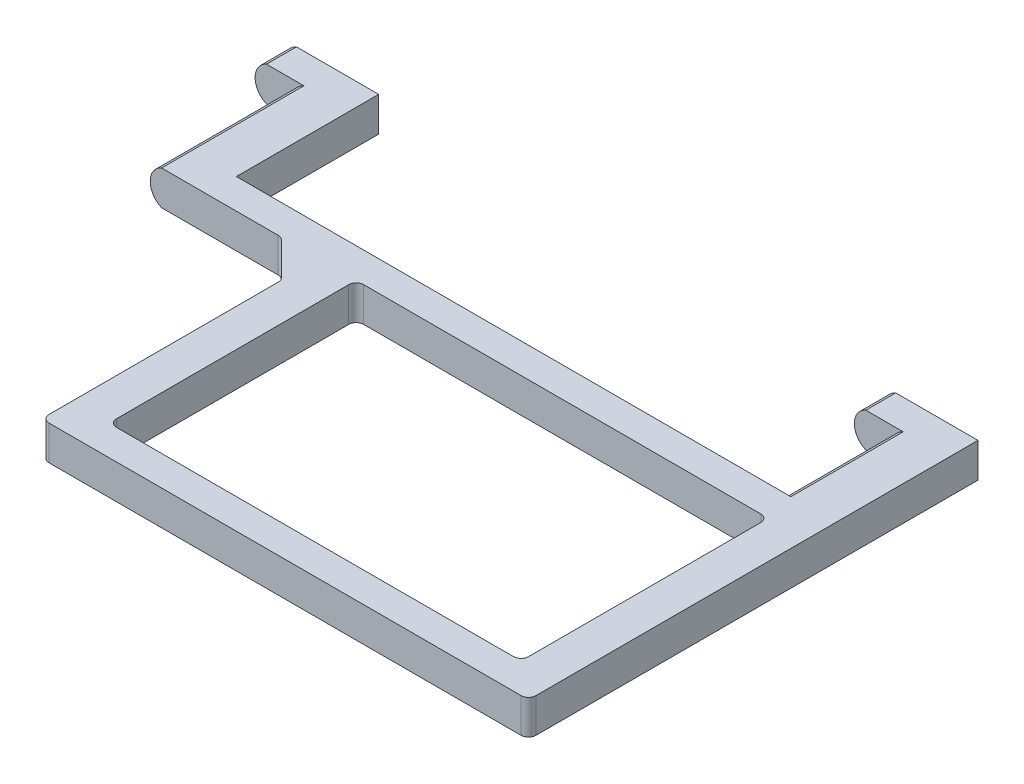
ISO-10303-21;
HEADER;
FILE_DESCRIPTION(('STEP AP214'),'2;1');
FILE_NAME('part.step','',(''),(''),'','','');
FILE_SCHEMA(('AUTOMOTIVE_DESIGN { 1 0 10303 214 1 1 1 1 }'));
ENDSEC;
DATA;
#1=APPLICATION_CONTEXT('core data for automotive mechanical design processes');
#2=APPLICATION_PROTOCOL_DEFINITION('international standard','automotive_design',2000,#1);
#3=PRODUCT_CONTEXT('',#1,'mechanical');
#4=PRODUCT('Part','Part','',(#3));
#5=PRODUCT_RELATED_PRODUCT_CATEGORY('part','',(#4));
#6=PRODUCT_DEFINITION_FORMATION('','',#4);
#7=PRODUCT_DEFINITION_CONTEXT('part definition',#1,'design');
#8=PRODUCT_DEFINITION('design','',#6,#7);
#9=PRODUCT_DEFINITION_SHAPE('','',#8);
#10=(LENGTH_UNIT() NAMED_UNIT(*) SI_UNIT(.MILLI.,.METRE.));
#11=(NAMED_UNIT(*) PLANE_ANGLE_UNIT() SI_UNIT($,.RADIAN.));
#12=(NAMED_UNIT(*) SI_UNIT($,.STERADIAN.) SOLID_ANGLE_UNIT());
#13=UNCERTAINTY_MEASURE_WITH_UNIT(LENGTH_MEASURE(1.E-05),#10,'distance_accuracy_value','');
#14=(GEOMETRIC_REPRESENTATION_CONTEXT(3) GLOBAL_UNCERTAINTY_ASSIGNED_CONTEXT((#13)) GLOBAL_UNIT_ASSIGNED_CONTEXT((#10,
#11,#12)) REPRESENTATION_CONTEXT('',''));
#15=CARTESIAN_POINT('',(0.,0.,0.));
#16=DIRECTION('',(0.,0.,1.));
#17=DIRECTION('',(1.,0.,0.));
#18=AXIS2_PLACEMENT_3D('',#15,#16,#17);
#19=CARTESIAN_POINT('',(449.301234579366,450.244075085687,-19.));
#20=DIRECTION('',(0.,0.,-1.));
#21=DIRECTION('',(-1.,0.,0.));
#22=AXIS2_PLACEMENT_3D('',#19,#20,#21);
#23=PLANE('',#22);
#24=DIRECTION('',(1.,0.,0.));
#25=VECTOR('',#24,1.);
#26=CARTESIAN_POINT('',(540.587671672653,452.544075085687,-19.));
#27=LINE('',#26,#25);
#28=CARTESIAN_POINT('',(448.321438682253,452.544075085687,-19.));
#29=VERTEX_POINT('',#28);
#30=CARTESIAN_POINT('',(459.301234579366,452.544075085687,-19.));
#31=VERTEX_POINT('',#30);
#32=EDGE_CURVE('E262',#29,#31,#27,.T.);
#33=ORIENTED_EDGE('',*,*,#32,.T.);
#34=DIRECTION('',(0.,-1.,0.));
#35=VECTOR('',#34,1.);
#36=CARTESIAN_POINT('',(459.301234579366,452.744075085687,-19.));
#37=LINE('',#36,#35);
#38=CARTESIAN_POINT('',(459.301234579366,447.944075085687,-19.));
#39=VERTEX_POINT('',#38);
#40=EDGE_CURVE('E328',#31,#39,#37,.T.);
#41=ORIENTED_EDGE('',*,*,#40,.T.);
#42=DIRECTION('',(-1.,0.,0.));
#43=VECTOR('',#42,1.);
#44=CARTESIAN_POINT('',(540.587671672653,447.944075085687,-19.));
#45=LINE('',#44,#43);
#46=CARTESIAN_POINT('',(448.321438682253,447.944075085687,-19.));
#47=VERTEX_POINT('',#46);
#48=EDGE_CURVE('E441',#39,#47,#45,.T.);
#49=ORIENTED_EDGE('',*,*,#48,.T.);
#50=CARTESIAN_POINT('',(449.301234579366,450.244075085687,-19.));
#51=DIRECTION('',(0.,0.,-1.));
#52=DIRECTION('',(-1.,0.,0.));
#53=AXIS2_PLACEMENT_3D('',#50,#51,#52);
#54=CIRCLE('',#53,2.5);
#55=EDGE_CURVE('E325',#47,#29,#54,.T.);
#56=ORIENTED_EDGE('',*,*,#55,.T.);
#57=EDGE_LOOP('',(#33,#41,#49,#56));
#58=FACE_BOUND('',#57,.T.);
#59=ADVANCED_FACE('F39',(#58),#23,.T.);
#60=CARTESIAN_POINT('',(449.301234579366,450.244075085687,-15.));
#61=DIRECTION('',(0.,0.,-1.));
#62=DIRECTION('',(-1.,0.,0.));
#63=AXIS2_PLACEMENT_3D('',#60,#61,#62);
#64=PLANE('',#63);
#65=CARTESIAN_POINT('',(454.301234579366,450.244075085687,-15.));
#66=DIRECTION('',(0.,0.,1.));
#67=DIRECTION('',(1.,0.,0.));
#68=AXIS2_PLACEMENT_3D('',#65,#66,#67);
#69=CIRCLE('',#68,2.5);
#70=CARTESIAN_POINT('',(453.321438682253,447.944075085687,-15.));
#71=VERTEX_POINT('',#70);
#72=CARTESIAN_POINT('',(453.321438682253,452.544075085687,-15.));
#73=VERTEX_POINT('',#72);
#74=EDGE_CURVE('E318',#71,#73,#69,.F.);
#75=ORIENTED_EDGE('',*,*,#74,.T.);
#76=DIRECTION('',(-1.,0.,0.));
#77=VECTOR('',#76,1.);
#78=CARTESIAN_POINT('',(449.301234579366,452.544075085687,-15.));
#79=LINE('',#78,#77);
#80=CARTESIAN_POINT('',(448.321438682253,452.544075085687,-15.));
#81=VERTEX_POINT('',#80);
#82=EDGE_CURVE('E372',#73,#81,#79,.T.);
#83=ORIENTED_EDGE('',*,*,#82,.T.);
#84=CARTESIAN_POINT('',(449.301234579366,450.244075085687,-15.));
#85=DIRECTION('',(0.,0.,-1.));
#86=DIRECTION('',(-1.,0.,0.));
#87=AXIS2_PLACEMENT_3D('',#84,#85,#86);
#88=CIRCLE('',#87,2.5);
#89=CARTESIAN_POINT('',(448.321438682253,447.944075085687,-15.));
#90=VERTEX_POINT('',#89);
#91=EDGE_CURVE('E322',#90,#81,#88,.T.);
#92=ORIENTED_EDGE('',*,*,#91,.F.);
#93=DIRECTION('',(1.,0.,0.));
#94=VECTOR('',#93,1.);
#95=CARTESIAN_POINT('',(449.301234579366,447.944075085687,-15.));
#96=LINE('',#95,#94);
#97=EDGE_CURVE('E427',#90,#71,#96,.T.);
#98=ORIENTED_EDGE('',*,*,#97,.T.);
#99=EDGE_LOOP('',(#75,#83,#92,#98));
#100=FACE_BOUND('',#99,.T.);
#101=ADVANCED_FACE('F500',(#100),#64,.F.);
#102=CARTESIAN_POINT('',(449.301234579366,450.244075085687,-19.));
#103=DIRECTION('',(0.,0.,1.));
#104=DIRECTION('',(1.,0.,0.));
#105=AXIS2_PLACEMENT_3D('',#102,#103,#104);
#106=CYLINDRICAL_SURFACE('',#105,2.5);
#107=ORIENTED_EDGE('',*,*,#91,.T.);
#108=DIRECTION('',(0.,0.,1.));
#109=VECTOR('',#108,1.);
#110=CARTESIAN_POINT('',(448.321438682253,452.544075085687,-19.));
#111=LINE('',#110,#109);
#112=EDGE_CURVE('E369',#81,#29,#111,.F.);
#113=ORIENTED_EDGE('',*,*,#112,.T.);
#114=ORIENTED_EDGE('',*,*,#55,.F.);
#115=DIRECTION('',(0.,0.,1.));
#116=VECTOR('',#115,1.);
#117=CARTESIAN_POINT('',(448.321438682253,447.944075085687,-19.));
#118=LINE('',#117,#116);
#119=EDGE_CURVE('E227',#47,#90,#118,.T.);
#120=ORIENTED_EDGE('',*,*,#119,.T.);
#121=EDGE_LOOP('',(#107,#113,#114,#120));
#122=FACE_BOUND('',#121,.T.);
#123=ADVANCED_FACE('F502',(#122),#106,.T.);
#124=CARTESIAN_POINT('',(459.301234579366,452.744075085687,-24.01387818866));
#125=DIRECTION('',(1.,0.,0.));
#126=DIRECTION('',(0.,0.,-1.));
#127=AXIS2_PLACEMENT_3D('',#124,#125,#126);
#128=PLANE('',#127);
#129=DIRECTION('',(0.,0.,-1.));
#130=VECTOR('',#129,1.);
#131=CARTESIAN_POINT('',(459.301234579366,452.544075085687,-24.01387818866));
#132=LINE('',#131,#130);
#133=CARTESIAN_POINT('',(459.301234579366,452.544075085687,0.));
#134=VERTEX_POINT('',#133);
#135=EDGE_CURVE('E344',#134,#31,#132,.T.);
#136=ORIENTED_EDGE('',*,*,#135,.F.);
#137=DIRECTION('',(0.,1.,0.));
#138=VECTOR('',#137,1.);
#139=CARTESIAN_POINT('',(459.301234579366,452.744075085687,0.));
#140=LINE('',#139,#138);
#141=CARTESIAN_POINT('',(459.301234579366,447.944075085687,0.));
#142=VERTEX_POINT('',#141);
#143=EDGE_CURVE('E319',#142,#134,#140,.T.);
#144=ORIENTED_EDGE('',*,*,#143,.F.);
#145=DIRECTION('',(0.,0.,1.));
#146=VECTOR('',#145,1.);
#147=CARTESIAN_POINT('',(459.301234579366,447.944075085687,-24.01387818866));
#148=LINE('',#147,#146);
#149=EDGE_CURVE('E401',#39,#142,#148,.T.);
#150=ORIENTED_EDGE('',*,*,#149,.F.);
#151=ORIENTED_EDGE('',*,*,#40,.F.);
#152=EDGE_LOOP('',(#136,#144,#150,#151));
#153=FACE_BOUND('',#152,.T.);
#154=ADVANCED_FACE('F457',(#153),#128,.T.);
#155=CARTESIAN_POINT('',(454.301234579366,450.244075085687,0.));
#156=DIRECTION('',(0.,0.,1.));
#157=DIRECTION('',(1.,0.,0.));
#158=AXIS2_PLACEMENT_3D('',#155,#156,#157);
#159=PLANE('',#158);
#160=ORIENTED_EDGE('',*,*,#143,.T.);
#161=DIRECTION('',(1.,0.,0.));
#162=VECTOR('',#161,1.);
#163=CARTESIAN_POINT('',(454.301234579366,452.544075085687,0.));
#164=LINE('',#163,#162);
#165=CARTESIAN_POINT('',(533.321438682253,452.544075085687,0.));
#166=VERTEX_POINT('',#165);
#167=EDGE_CURVE('E341',#134,#166,#164,.T.);
#168=ORIENTED_EDGE('',*,*,#167,.T.);
#169=CARTESIAN_POINT('',(534.301234579366,450.244075085687,0.));
#170=DIRECTION('',(0.,0.,1.));
#171=DIRECTION('',(1.,0.,0.));
#172=AXIS2_PLACEMENT_3D('',#169,#170,#171);
#173=CIRCLE('',#172,2.5);
#174=CARTESIAN_POINT('',(533.321438682253,447.944075085687,0.));
#175=VERTEX_POINT('',#174);
#176=EDGE_CURVE('E300',#166,#175,#173,.T.);
#177=ORIENTED_EDGE('',*,*,#176,.T.);
#178=DIRECTION('',(-1.,0.,0.));
#179=VECTOR('',#178,1.);
#180=CARTESIAN_POINT('',(454.301234579366,447.944075085687,0.));
#181=LINE('',#180,#179);
#182=EDGE_CURVE('E398',#175,#142,#181,.T.);
#183=ORIENTED_EDGE('',*,*,#182,.T.);
#184=EDGE_LOOP('',(#160,#168,#177,#183));
#185=FACE_BOUND('',#184,.T.);
#186=ADVANCED_FACE('F461',(#185),#159,.F.);
#187=CARTESIAN_POINT('',(454.301234579366,450.244075085687,4.));
#188=DIRECTION('',(0.,0.,-1.));
#189=DIRECTION('',(-1.,0.,0.));
#190=AXIS2_PLACEMENT_3D('',#187,#188,#189);
#191=CYLINDRICAL_SURFACE('',#190,2.5);
#192=CARTESIAN_POINT('',(454.301234579366,450.244075085687,4.));
#193=DIRECTION('',(0.,0.,1.));
#194=DIRECTION('',(1.,0.,0.));
#195=AXIS2_PLACEMENT_3D('',#192,#193,#194);
#196=CIRCLE('',#195,2.5);
#197=CARTESIAN_POINT('',(453.321438682253,452.544075085687,4.));
#198=VERTEX_POINT('',#197);
#199=CARTESIAN_POINT('',(453.321438682253,447.944075085687,4.));
#200=VERTEX_POINT('',#199);
#201=EDGE_CURVE('E311',#198,#200,#196,.T.);
#202=ORIENTED_EDGE('',*,*,#201,.F.);
#203=DIRECTION('',(0.,0.,-1.));
#204=VECTOR('',#203,1.);
#205=CARTESIAN_POINT('',(453.321438682253,452.544075085687,4.));
#206=LINE('',#205,#204);
#207=EDGE_CURVE('E375',#198,#73,#206,.T.);
#208=ORIENTED_EDGE('',*,*,#207,.T.);
#209=ORIENTED_EDGE('',*,*,#74,.F.);
#210=DIRECTION('',(0.,0.,-1.));
#211=VECTOR('',#210,1.);
#212=CARTESIAN_POINT('',(453.321438682253,447.944075085687,4.));
#213=LINE('',#212,#211);
#214=EDGE_CURVE('E430',#71,#200,#213,.F.);
#215=ORIENTED_EDGE('',*,*,#214,.T.);
#216=EDGE_LOOP('',(#202,#208,#209,#215));
#217=FACE_BOUND('',#216,.T.);
#218=ADVANCED_FACE('F496',(#217),#191,.T.);
#219=CARTESIAN_POINT('',(529.301234579366,450.244075085687,-19.));
#220=DIRECTION('',(0.,0.,-1.));
#221=DIRECTION('',(-1.,0.,0.));
#222=AXIS2_PLACEMENT_3D('',#219,#220,#221);
#223=PLANE('',#222);
#224=CARTESIAN_POINT('',(528.321438682253,452.544075085687,-19.));
#225=VERTEX_POINT('',#224);
#226=CARTESIAN_POINT('',(539.301234579366,452.544075085687,-19.));
#227=VERTEX_POINT('',#226);
#228=EDGE_CURVE('E445',#225,#227,#27,.T.);
#229=ORIENTED_EDGE('',*,*,#228,.T.);
#230=DIRECTION('',(0.,-1.,0.));
#231=VECTOR('',#230,1.);
#232=CARTESIAN_POINT('',(539.301234579366,452.744075085687,-19.));
#233=LINE('',#232,#231);
#234=CARTESIAN_POINT('',(539.301234579366,447.944075085687,-19.));
#235=VERTEX_POINT('',#234);
#236=EDGE_CURVE('E304',#227,#235,#233,.T.);
#237=ORIENTED_EDGE('',*,*,#236,.T.);
#238=CARTESIAN_POINT('',(528.321438682253,447.944075085687,-19.));
#239=VERTEX_POINT('',#238);
#240=EDGE_CURVE('E238',#235,#239,#45,.T.);
#241=ORIENTED_EDGE('',*,*,#240,.T.);
#242=CARTESIAN_POINT('',(529.301234579366,450.244075085687,-19.));
#243=DIRECTION('',(0.,0.,-1.));
#244=DIRECTION('',(-1.,0.,0.));
#245=AXIS2_PLACEMENT_3D('',#242,#243,#244);
#246=CIRCLE('',#245,2.5);
#247=EDGE_CURVE('E310',#239,#225,#246,.T.);
#248=ORIENTED_EDGE('',*,*,#247,.T.);
#249=EDGE_LOOP('',(#229,#237,#241,#248));
#250=FACE_BOUND('',#249,.T.);
#251=ADVANCED_FACE('F474',(#250),#223,.T.);
#252=CARTESIAN_POINT('',(529.301234579366,450.244075085687,-15.));
#253=DIRECTION('',(0.,0.,-1.));
#254=DIRECTION('',(-1.,0.,0.));
#255=AXIS2_PLACEMENT_3D('',#252,#253,#254);
#256=PLANE('',#255);
#257=CARTESIAN_POINT('',(534.301234579366,450.244075085687,-15.));
#258=DIRECTION('',(0.,0.,1.));
#259=DIRECTION('',(1.,0.,0.));
#260=AXIS2_PLACEMENT_3D('',#257,#258,#259);
#261=CIRCLE('',#260,2.5);
#262=CARTESIAN_POINT('',(533.321438682253,447.944075085687,-15.));
#263=VERTEX_POINT('',#262);
#264=CARTESIAN_POINT('',(533.321438682253,452.544075085687,-15.));
#265=VERTEX_POINT('',#264);
#266=EDGE_CURVE('E301',#263,#265,#261,.F.);
#267=ORIENTED_EDGE('',*,*,#266,.T.);
#268=DIRECTION('',(-1.,0.,0.));
#269=VECTOR('',#268,1.);
#270=CARTESIAN_POINT('',(529.301234579366,452.544075085687,-15.));
#271=LINE('',#270,#269);
#272=CARTESIAN_POINT('',(528.321438682253,452.544075085687,-15.));
#273=VERTEX_POINT('',#272);
#274=EDGE_CURVE('E336',#265,#273,#271,.T.);
#275=ORIENTED_EDGE('',*,*,#274,.T.);
#276=CARTESIAN_POINT('',(529.301234579366,450.244075085687,-15.));
#277=DIRECTION('',(0.,0.,-1.));
#278=DIRECTION('',(-1.,0.,0.));
#279=AXIS2_PLACEMENT_3D('',#276,#277,#278);
#280=CIRCLE('',#279,2.5);
#281=CARTESIAN_POINT('',(528.321438682253,447.944075085687,-15.));
#282=VERTEX_POINT('',#281);
#283=EDGE_CURVE('E307',#282,#273,#280,.T.);
#284=ORIENTED_EDGE('',*,*,#283,.F.);
#285=DIRECTION('',(1.,0.,0.));
#286=VECTOR('',#285,1.);
#287=CARTESIAN_POINT('',(529.301234579366,447.944075085687,-15.));
#288=LINE('',#287,#286);
#289=EDGE_CURVE('E393',#282,#263,#288,.T.);
#290=ORIENTED_EDGE('',*,*,#289,.T.);
#291=EDGE_LOOP('',(#267,#275,#284,#290));
#292=FACE_BOUND('',#291,.T.);
#293=ADVANCED_FACE('F469',(#292),#256,.F.);
#294=CARTESIAN_POINT('',(529.301234579366,450.244075085687,-19.));
#295=DIRECTION('',(0.,0.,1.));
#296=DIRECTION('',(1.,0.,0.));
#297=AXIS2_PLACEMENT_3D('',#294,#295,#296);
#298=CYLINDRICAL_SURFACE('',#297,2.5);
#299=ORIENTED_EDGE('',*,*,#283,.T.);
#300=DIRECTION('',(0.,0.,1.));
#301=VECTOR('',#300,1.);
#302=CARTESIAN_POINT('',(528.321438682253,452.544075085687,-19.));
#303=LINE('',#302,#301);
#304=EDGE_CURVE('E331',#273,#225,#303,.F.);
#305=ORIENTED_EDGE('',*,*,#304,.T.);
#306=ORIENTED_EDGE('',*,*,#247,.F.);
#307=DIRECTION('',(0.,0.,1.));
#308=VECTOR('',#307,1.);
#309=CARTESIAN_POINT('',(528.321438682253,447.944075085687,-19.));
#310=LINE('',#309,#308);
#311=EDGE_CURVE('E390',#239,#282,#310,.T.);
#312=ORIENTED_EDGE('',*,*,#311,.T.);
#313=EDGE_LOOP('',(#299,#305,#306,#312));
#314=FACE_BOUND('',#313,.T.);
#315=ADVANCED_FACE('F471',(#314),#298,.T.);
#316=CARTESIAN_POINT('',(473.301234579366,447.744075085687,9.41421356237312));
#317=DIRECTION('',(0.,-1.,0.));
#318=DIRECTION('',(0.,0.,-1.));
#319=AXIS2_PLACEMENT_3D('',#316,#317,#318);
#320=CYLINDRICAL_SURFACE('',#319,1.);
#321=DIRECTION('',(0.,-1.,0.));
#322=VECTOR('',#321,1.);
#323=CARTESIAN_POINT('',(474.301234579366,447.744075085687,9.41421356237312));
#324=LINE('',#323,#322);
#325=CARTESIAN_POINT('',(474.301234579366,452.544075085687,9.41421356237312));
#326=VERTEX_POINT('',#325);
#327=CARTESIAN_POINT('',(474.301234579366,447.944075085687,9.41421356237312));
#328=VERTEX_POINT('',#327);
#329=EDGE_CURVE('E246',#326,#328,#324,.T.);
#330=ORIENTED_EDGE('',*,*,#329,.F.);
#331=CARTESIAN_POINT('',(473.301234579366,452.544075085687,9.41421356237312));
#332=DIRECTION('',(0.,-1.,0.));
#333=DIRECTION('',(0.,0.,-1.));
#334=AXIS2_PLACEMENT_3D('',#331,#332,#333);
#335=CIRCLE('',#334,1.);
#336=CARTESIAN_POINT('',(474.008341360553,452.544075085687,8.70710678118659));
#337=VERTEX_POINT('',#336);
#338=EDGE_CURVE('E385',#326,#337,#335,.F.);
#339=ORIENTED_EDGE('',*,*,#338,.T.);
#340=DIRECTION('',(0.,-1.,0.));
#341=VECTOR('',#340,1.);
#342=CARTESIAN_POINT('',(474.008341360553,459.815142897552,8.70710678118657));
#343=LINE('',#342,#341);
#344=CARTESIAN_POINT('',(474.008341360553,447.944075085687,8.70710678118659));
#345=VERTEX_POINT('',#344);
#346=EDGE_CURVE('E273',#345,#337,#343,.F.);
#347=ORIENTED_EDGE('',*,*,#346,.F.);
#348=CARTESIAN_POINT('',(473.301234579366,447.944075085687,9.41421356237312));
#349=DIRECTION('',(0.,1.,0.));
#350=DIRECTION('',(0.,0.,1.));
#351=AXIS2_PLACEMENT_3D('',#348,#349,#350);
#352=CIRCLE('',#351,1.);
#353=EDGE_CURVE('E261',#345,#328,#352,.F.);
#354=ORIENTED_EDGE('',*,*,#353,.T.);
#355=EDGE_LOOP('',(#330,#339,#347,#354));
#356=FACE_BOUND('',#355,.T.);
#357=ADVANCED_FACE('F480',(#356),#320,.F.);
#358=CARTESIAN_POINT('',(468.887021016993,459.815142897552,5.));
#359=DIRECTION('',(0.,1.,0.));
#360=DIRECTION('',(0.,0.,1.));
#361=AXIS2_PLACEMENT_3D('',#358,#359,#360);
#362=CYLINDRICAL_SURFACE('',#361,1.);
#363=DIRECTION('',(0.,-1.,0.));
#364=VECTOR('',#363,1.);
#365=CARTESIAN_POINT('',(469.59412779818,447.744075085687,4.29289321881343));
#366=LINE('',#365,#364);
#367=CARTESIAN_POINT('',(469.59412779818,452.544075085687,4.29289321881345));
#368=VERTEX_POINT('',#367);
#369=CARTESIAN_POINT('',(469.59412779818,447.944075085687,4.29289321881345));
#370=VERTEX_POINT('',#369);
#371=EDGE_CURVE('E268',#368,#370,#366,.T.);
#372=ORIENTED_EDGE('',*,*,#371,.F.);
#373=CARTESIAN_POINT('',(468.887021016993,452.544075085687,5.));
#374=DIRECTION('',(0.,-1.,0.));
#375=DIRECTION('',(0.,0.,-1.));
#376=AXIS2_PLACEMENT_3D('',#373,#374,#375);
#377=CIRCLE('',#376,1.);
#378=CARTESIAN_POINT('',(468.887021016993,452.544075085687,4.));
#379=VERTEX_POINT('',#378);
#380=EDGE_CURVE('E380',#368,#379,#377,.F.);
#381=ORIENTED_EDGE('',*,*,#380,.T.);
#382=DIRECTION('',(0.,-1.,0.));
#383=VECTOR('',#382,1.);
#384=CARTESIAN_POINT('',(468.887021016993,452.744075085687,4.));
#385=LINE('',#384,#383);
#386=CARTESIAN_POINT('',(468.887021016993,447.944075085687,4.));
#387=VERTEX_POINT('',#386);
#388=EDGE_CURVE('E265',#387,#379,#385,.F.);
#389=ORIENTED_EDGE('',*,*,#388,.F.);
#390=CARTESIAN_POINT('',(468.887021016993,447.944075085687,5.));
#391=DIRECTION('',(0.,1.,0.));
#392=DIRECTION('',(0.,0.,1.));
#393=AXIS2_PLACEMENT_3D('',#390,#391,#392);
#394=CIRCLE('',#393,1.);
#395=EDGE_CURVE('E435',#387,#370,#394,.F.);
#396=ORIENTED_EDGE('',*,*,#395,.T.);
#397=EDGE_LOOP('',(#372,#381,#389,#396));
#398=FACE_BOUND('',#397,.T.);
#399=ADVANCED_FACE('F488',(#398),#362,.F.);
#400=CARTESIAN_POINT('',(469.301234579366,459.815142897552,4.));
#401=DIRECTION('',(-0.707106781186547,0.,0.707106781186547));
#402=DIRECTION('',(0.707106781186548,0.,0.707106781186547));
#403=AXIS2_PLACEMENT_3D('',#400,#401,#402);
#404=PLANE('',#403);
#405=DIRECTION('',(0.707106781186548,0.,0.707106781186547));
#406=VECTOR('',#405,1.);
#407=CARTESIAN_POINT('',(469.301234579366,452.544075085687,4.));
#408=LINE('',#407,#406);
#409=EDGE_CURVE('E383',#368,#337,#408,.T.);
#410=ORIENTED_EDGE('',*,*,#409,.F.);
#411=ORIENTED_EDGE('',*,*,#371,.T.);
#412=DIRECTION('',(-0.707106781186548,0.,-0.707106781186547));
#413=VECTOR('',#412,1.);
#414=CARTESIAN_POINT('',(469.301234579366,447.944075085687,4.));
#415=LINE('',#414,#413);
#416=EDGE_CURVE('E438',#345,#370,#415,.T.);
#417=ORIENTED_EDGE('',*,*,#416,.F.);
#418=ORIENTED_EDGE('',*,*,#346,.T.);
#419=EDGE_LOOP('',(#410,#411,#417,#418));
#420=FACE_BOUND('',#419,.T.);
#421=ADVANCED_FACE('F485',(#420),#404,.T.);
#422=CARTESIAN_POINT('',(475.301234579366,0.,40.));
#423=DIRECTION('',(0.,-1.,0.));
#424=DIRECTION('',(0.,0.,-1.));
#425=AXIS2_PLACEMENT_3D('',#422,#423,#424);
#426=CYLINDRICAL_SURFACE('',#425,1.);
#427=CARTESIAN_POINT('',(475.301234579366,452.544075085687,40.));
#428=DIRECTION('',(0.,-1.,0.));
#429=DIRECTION('',(0.,0.,-1.));
#430=AXIS2_PLACEMENT_3D('',#427,#428,#429);
#431=CIRCLE('',#430,1.);
#432=CARTESIAN_POINT('',(474.301234579366,452.544075085687,40.));
#433=VERTEX_POINT('',#432);
#434=CARTESIAN_POINT('',(475.301234579366,452.544075085687,41.));
#435=VERTEX_POINT('',#434);
#436=EDGE_CURVE('E11',#433,#435,#431,.F.);
#437=ORIENTED_EDGE('',*,*,#436,.F.);
#438=DIRECTION('',(0.,-1.,0.));
#439=VECTOR('',#438,1.);
#440=CARTESIAN_POINT('',(474.301234579366,447.744075085687,40.));
#441=LINE('',#440,#439);
#442=CARTESIAN_POINT('',(474.301234579366,447.944075085687,40.));
#443=VERTEX_POINT('',#442);
#444=EDGE_CURVE('E259',#443,#433,#441,.F.);
#445=ORIENTED_EDGE('',*,*,#444,.F.);
#446=CARTESIAN_POINT('',(475.301234579366,447.944075085687,40.));
#447=DIRECTION('',(0.,1.,0.));
#448=DIRECTION('',(0.,0.,1.));
#449=AXIS2_PLACEMENT_3D('',#446,#447,#448);
#450=CIRCLE('',#449,1.);
#451=CARTESIAN_POINT('',(475.301234579366,447.944075085687,41.));
#452=VERTEX_POINT('',#451);
#453=EDGE_CURVE('E47',#452,#443,#450,.F.);
#454=ORIENTED_EDGE('',*,*,#453,.F.);
#455=DIRECTION('',(0.,-1.,0.));
#456=VECTOR('',#455,1.);
#457=CARTESIAN_POINT('',(475.301234579366,0.,41.));
#458=LINE('',#457,#456);
#459=EDGE_CURVE('E236',#435,#452,#458,.T.);
#460=ORIENTED_EDGE('',*,*,#459,.F.);
#461=EDGE_LOOP('',(#437,#445,#454,#460));
#462=FACE_BOUND('',#461,.T.);
#463=ADVANCED_FACE('F41',(#462),#426,.T.);
#464=CARTESIAN_POINT('',(474.301234579366,447.744075085687,41.));
#465=DIRECTION('',(1.,0.,0.));
#466=DIRECTION('',(0.,0.,-1.));
#467=AXIS2_PLACEMENT_3D('',#464,#465,#466);
#468=PLANE('',#467);
#469=ORIENTED_EDGE('',*,*,#444,.T.);
#470=DIRECTION('',(0.,0.,-1.));
#471=VECTOR('',#470,1.);
#472=CARTESIAN_POINT('',(474.301234579366,452.544075085687,41.));
#473=LINE('',#472,#471);
#474=EDGE_CURVE('E388',#433,#326,#473,.T.);
#475=ORIENTED_EDGE('',*,*,#474,.T.);
#476=ORIENTED_EDGE('',*,*,#329,.T.);
#477=DIRECTION('',(0.,0.,1.));
#478=VECTOR('',#477,1.);
#479=CARTESIAN_POINT('',(474.301234579366,447.944075085687,41.));
#480=LINE('',#479,#478);
#481=EDGE_CURVE('E250',#328,#443,#480,.T.);
#482=ORIENTED_EDGE('',*,*,#481,.T.);
#483=EDGE_LOOP('',(#469,#475,#476,#482));
#484=FACE_BOUND('',#483,.T.);
#485=ADVANCED_FACE('F257',(#484),#468,.F.);
#486=CARTESIAN_POINT('',(538.301234579366,0.,40.));
#487=DIRECTION('',(0.,-1.,0.));
#488=DIRECTION('',(0.,0.,-1.));
#489=AXIS2_PLACEMENT_3D('',#486,#487,#488);
#490=CYLINDRICAL_SURFACE('',#489,1.);
#491=CARTESIAN_POINT('',(538.301234579366,452.544075085687,40.));
#492=DIRECTION('',(0.,-1.,0.));
#493=DIRECTION('',(0.,0.,-1.));
#494=AXIS2_PLACEMENT_3D('',#491,#492,#493);
#495=CIRCLE('',#494,1.);
#496=CARTESIAN_POINT('',(538.301234579366,452.544075085687,41.));
#497=VERTEX_POINT('',#496);
#498=CARTESIAN_POINT('',(539.301234579366,452.544075085687,40.));
#499=VERTEX_POINT('',#498);
#500=EDGE_CURVE('E242',#497,#499,#495,.F.);
#501=ORIENTED_EDGE('',*,*,#500,.F.);
#502=DIRECTION('',(0.,1.,0.));
#503=VECTOR('',#502,1.);
#504=CARTESIAN_POINT('',(538.301234579366,452.744075085687,41.));
#505=LINE('',#504,#503);
#506=CARTESIAN_POINT('',(538.301234579366,447.944075085687,41.));
#507=VERTEX_POINT('',#506);
#508=EDGE_CURVE('E234',#507,#497,#505,.T.);
#509=ORIENTED_EDGE('',*,*,#508,.F.);
#510=CARTESIAN_POINT('',(538.301234579366,447.944075085687,40.));
#511=DIRECTION('',(0.,1.,0.));
#512=DIRECTION('',(0.,0.,1.));
#513=AXIS2_PLACEMENT_3D('',#510,#511,#512);
#514=CIRCLE('',#513,1.);
#515=CARTESIAN_POINT('',(539.301234579366,447.944075085687,40.));
#516=VERTEX_POINT('',#515);
#517=EDGE_CURVE('E216',#516,#507,#514,.F.);
#518=ORIENTED_EDGE('',*,*,#517,.F.);
#519=DIRECTION('',(0.,1.,0.));
#520=VECTOR('',#519,1.);
#521=CARTESIAN_POINT('',(539.301234579366,447.744075085687,40.));
#522=LINE('',#521,#520);
#523=EDGE_CURVE('E243',#499,#516,#522,.F.);
#524=ORIENTED_EDGE('',*,*,#523,.F.);
#525=EDGE_LOOP('',(#501,#509,#518,#524));
#526=FACE_BOUND('',#525,.T.);
#527=ADVANCED_FACE('F241',(#526),#490,.T.);
#528=CARTESIAN_POINT('',(0.,0.,41.));
#529=DIRECTION('',(0.,0.,-1.));
#530=DIRECTION('',(-1.,0.,0.));
#531=AXIS2_PLACEMENT_3D('',#528,#529,#530);
#532=PLANE('',#531);
#533=ORIENTED_EDGE('',*,*,#508,.T.);
#534=DIRECTION('',(1.,0.,0.));
#535=VECTOR('',#534,1.);
#536=CARTESIAN_POINT('',(540.587671672653,452.544075085687,41.));
#537=LINE('',#536,#535);
#538=EDGE_CURVE('E237',#435,#497,#537,.T.);
#539=ORIENTED_EDGE('',*,*,#538,.F.);
#540=ORIENTED_EDGE('',*,*,#459,.T.);
#541=DIRECTION('',(-1.,0.,0.));
#542=VECTOR('',#541,1.);
#543=CARTESIAN_POINT('',(540.587671672653,447.944075085687,41.));
#544=LINE('',#543,#542);
#545=EDGE_CURVE('E219',#507,#452,#544,.T.);
#546=ORIENTED_EDGE('',*,*,#545,.F.);
#547=EDGE_LOOP('',(#533,#539,#540,#546));
#548=FACE_BOUND('',#547,.T.);
#549=ADVANCED_FACE('F232',(#548),#532,.F.);
#550=CARTESIAN_POINT('',(539.301234579366,452.744075085687,-24.01387818866));
#551=DIRECTION('',(1.,0.,0.));
#552=DIRECTION('',(0.,0.,-1.));
#553=AXIS2_PLACEMENT_3D('',#550,#551,#552);
#554=PLANE('',#553);
#555=DIRECTION('',(0.,0.,-1.));
#556=VECTOR('',#555,1.);
#557=CARTESIAN_POINT('',(539.301234579366,452.544075085687,-24.01387818866));
#558=LINE('',#557,#556);
#559=EDGE_CURVE('E366',#499,#227,#558,.T.);
#560=ORIENTED_EDGE('',*,*,#559,.F.);
#561=ORIENTED_EDGE('',*,*,#523,.T.);
#562=DIRECTION('',(0.,0.,1.));
#563=VECTOR('',#562,1.);
#564=CARTESIAN_POINT('',(539.301234579366,447.944075085687,-24.01387818866));
#565=LINE('',#564,#563);
#566=EDGE_CURVE('E222',#235,#516,#565,.T.);
#567=ORIENTED_EDGE('',*,*,#566,.F.);
#568=ORIENTED_EDGE('',*,*,#236,.F.);
#569=EDGE_LOOP('',(#560,#561,#567,#568));
#570=FACE_BOUND('',#569,.T.);
#571=ADVANCED_FACE('F477',(#570),#554,.T.);
#572=CARTESIAN_POINT('',(534.301234579366,450.244075085687,-24.01387818866));
#573=DIRECTION('',(0.,0.,1.));
#574=DIRECTION('',(1.,0.,0.));
#575=AXIS2_PLACEMENT_3D('',#572,#573,#574);
#576=CYLINDRICAL_SURFACE('',#575,2.5);
#577=DIRECTION('',(0.,0.,1.));
#578=VECTOR('',#577,1.);
#579=CARTESIAN_POINT('',(533.321438682253,452.544075085687,-24.01387818866));
#580=LINE('',#579,#578);
#581=EDGE_CURVE('E339',#265,#166,#580,.T.);
#582=ORIENTED_EDGE('',*,*,#581,.F.);
#583=ORIENTED_EDGE('',*,*,#266,.F.);
#584=DIRECTION('',(0.,0.,1.));
#585=VECTOR('',#584,1.);
#586=CARTESIAN_POINT('',(533.321438682253,447.944075085687,-24.01387818866));
#587=LINE('',#586,#585);
#588=EDGE_CURVE('E396',#175,#263,#587,.F.);
#589=ORIENTED_EDGE('',*,*,#588,.F.);
#590=ORIENTED_EDGE('',*,*,#176,.F.);
#591=EDGE_LOOP('',(#582,#583,#589,#590));
#592=FACE_BOUND('',#591,.T.);
#593=ADVANCED_FACE('F465',(#592),#576,.T.);
#594=CARTESIAN_POINT('',(454.301234579366,450.244075085687,4.));
#595=DIRECTION('',(0.,0.,1.));
#596=DIRECTION('',(1.,0.,0.));
#597=AXIS2_PLACEMENT_3D('',#594,#595,#596);
#598=PLANE('',#597);
#599=DIRECTION('',(1.,0.,0.));
#600=VECTOR('',#599,1.);
#601=CARTESIAN_POINT('',(454.301234579366,452.544075085687,4.));
#602=LINE('',#601,#600);
#603=EDGE_CURVE('E378',#198,#379,#602,.T.);
#604=ORIENTED_EDGE('',*,*,#603,.F.);
#605=ORIENTED_EDGE('',*,*,#201,.T.);
#606=DIRECTION('',(-1.,0.,0.));
#607=VECTOR('',#606,1.);
#608=CARTESIAN_POINT('',(454.301234579366,447.944075085687,4.));
#609=LINE('',#608,#607);
#610=EDGE_CURVE('E433',#387,#200,#609,.T.);
#611=ORIENTED_EDGE('',*,*,#610,.F.);
#612=ORIENTED_EDGE('',*,*,#388,.T.);
#613=EDGE_LOOP('',(#604,#605,#611,#612));
#614=FACE_BOUND('',#613,.T.);
#615=ADVANCED_FACE('F493',(#614),#598,.T.);
#616=CARTESIAN_POINT('',(540.587671672653,447.944075085687,-19.));
#617=DIRECTION('',(0.,1.,0.));
#618=DIRECTION('',(0.,0.,1.));
#619=AXIS2_PLACEMENT_3D('',#616,#617,#618);
#620=PLANE('',#619);
#621=DIRECTION('',(0.,0.,1.));
#622=VECTOR('',#621,1.);
#623=CARTESIAN_POINT('',(534.301234579366,447.944075085687,41.));
#624=LINE('',#623,#622);
#625=CARTESIAN_POINT('',(534.301234579366,447.944075085687,5.));
#626=VERTEX_POINT('',#625);
#627=CARTESIAN_POINT('',(534.301234579366,447.944075085687,36.));
#628=VERTEX_POINT('',#627);
#629=EDGE_CURVE('E406',#626,#628,#624,.T.);
#630=ORIENTED_EDGE('',*,*,#629,.F.);
#631=CARTESIAN_POINT('',(533.301234579366,447.944075085687,5.));
#632=DIRECTION('',(0.,1.,0.));
#633=DIRECTION('',(0.,0.,1.));
#634=AXIS2_PLACEMENT_3D('',#631,#632,#633);
#635=CIRCLE('',#634,1.);
#636=CARTESIAN_POINT('',(533.301234579366,447.944075085687,4.));
#637=VERTEX_POINT('',#636);
#638=EDGE_CURVE('E415',#637,#626,#635,.F.);
#639=ORIENTED_EDGE('',*,*,#638,.F.);
#640=DIRECTION('',(-1.,0.,0.));
#641=VECTOR('',#640,1.);
#642=CARTESIAN_POINT('',(454.301234579366,447.944075085687,4.));
#643=LINE('',#642,#641);
#644=CARTESIAN_POINT('',(480.301234579366,447.944075085687,4.));
#645=VERTEX_POINT('',#644);
#646=EDGE_CURVE('E62',#637,#645,#643,.T.);
#647=ORIENTED_EDGE('',*,*,#646,.T.);
#648=CARTESIAN_POINT('',(480.301234579366,447.944075085687,5.));
#649=DIRECTION('',(0.,1.,0.));
#650=DIRECTION('',(0.,0.,1.));
#651=AXIS2_PLACEMENT_3D('',#648,#649,#650);
#652=CIRCLE('',#651,1.);
#653=CARTESIAN_POINT('',(479.301234579366,447.944075085687,5.));
#654=VERTEX_POINT('',#653);
#655=EDGE_CURVE('E422',#654,#645,#652,.F.);
#656=ORIENTED_EDGE('',*,*,#655,.F.);
#657=DIRECTION('',(0.,0.,-1.));
#658=VECTOR('',#657,1.);
#659=CARTESIAN_POINT('',(479.301234579366,447.944075085687,41.));
#660=LINE('',#659,#658);
#661=CARTESIAN_POINT('',(479.301234579366,447.944075085687,36.));
#662=VERTEX_POINT('',#661);
#663=EDGE_CURVE('E418',#662,#654,#660,.T.);
#664=ORIENTED_EDGE('',*,*,#663,.F.);
#665=CARTESIAN_POINT('',(480.301234579366,447.944075085687,36.));
#666=DIRECTION('',(0.,1.,0.));
#667=DIRECTION('',(0.,0.,1.));
#668=AXIS2_PLACEMENT_3D('',#665,#666,#667);
#669=CIRCLE('',#668,1.);
#670=CARTESIAN_POINT('',(480.301234579366,447.944075085687,37.));
#671=VERTEX_POINT('',#670);
#672=EDGE_CURVE('E412',#671,#662,#669,.F.);
#673=ORIENTED_EDGE('',*,*,#672,.F.);
#674=DIRECTION('',(-1.,0.,0.));
#675=VECTOR('',#674,1.);
#676=CARTESIAN_POINT('',(467.898110341933,447.944075085687,37.));
#677=LINE('',#676,#675);
#678=CARTESIAN_POINT('',(533.301234579366,447.944075085687,37.));
#679=VERTEX_POINT('',#678);
#680=EDGE_CURVE('E409',#679,#671,#677,.T.);
#681=ORIENTED_EDGE('',*,*,#680,.F.);
#682=CARTESIAN_POINT('',(533.301234579366,447.944075085687,36.));
#683=DIRECTION('',(0.,1.,0.));
#684=DIRECTION('',(0.,0.,1.));
#685=AXIS2_PLACEMENT_3D('',#682,#683,#684);
#686=CIRCLE('',#685,1.);
#687=EDGE_CURVE('E403',#628,#679,#686,.F.);
#688=ORIENTED_EDGE('',*,*,#687,.F.);
#689=EDGE_LOOP('',(#630,#639,#647,#656,#664,#673,#681,#688));
#690=FACE_BOUND('',#689,.T.);
#691=ORIENTED_EDGE('',*,*,#240,.F.);
#692=ORIENTED_EDGE('',*,*,#566,.T.);
#693=ORIENTED_EDGE('',*,*,#517,.T.);
#694=ORIENTED_EDGE('',*,*,#545,.T.);
#695=ORIENTED_EDGE('',*,*,#453,.T.);
#696=ORIENTED_EDGE('',*,*,#481,.F.);
#697=ORIENTED_EDGE('',*,*,#353,.F.);
#698=ORIENTED_EDGE('',*,*,#416,.T.);
#699=ORIENTED_EDGE('',*,*,#395,.F.);
#700=ORIENTED_EDGE('',*,*,#610,.T.);
#701=ORIENTED_EDGE('',*,*,#214,.F.);
#702=ORIENTED_EDGE('',*,*,#97,.F.);
#703=ORIENTED_EDGE('',*,*,#119,.F.);
#704=ORIENTED_EDGE('',*,*,#48,.F.);
#705=ORIENTED_EDGE('',*,*,#149,.T.);
#706=ORIENTED_EDGE('',*,*,#182,.F.);
#707=ORIENTED_EDGE('',*,*,#588,.T.);
#708=ORIENTED_EDGE('',*,*,#289,.F.);
#709=ORIENTED_EDGE('',*,*,#311,.F.);
#710=EDGE_LOOP('',(#691,#692,#693,#694,#695,#696,#697,#698,#699,#700,#701,#702,#703,#704,#705,
#706,#707,#708,#709));
#711=FACE_BOUND('',#710,.T.);
#712=ADVANCED_FACE('F218',(#690,#711),#620,.F.);
#713=CARTESIAN_POINT('',(540.587671672653,452.544075085687,-19.));
#714=DIRECTION('',(0.,-1.,0.));
#715=DIRECTION('',(0.,0.,-1.));
#716=AXIS2_PLACEMENT_3D('',#713,#714,#715);
#717=PLANE('',#716);
#718=DIRECTION('',(1.,0.,0.));
#719=VECTOR('',#718,1.);
#720=CARTESIAN_POINT('',(467.898110341933,452.544075085687,37.));
#721=LINE('',#720,#719);
#722=CARTESIAN_POINT('',(480.301234579366,452.544075085687,37.));
#723=VERTEX_POINT('',#722);
#724=CARTESIAN_POINT('',(533.301234579366,452.544075085687,37.));
#725=VERTEX_POINT('',#724);
#726=EDGE_CURVE('E352',#723,#725,#721,.T.);
#727=ORIENTED_EDGE('',*,*,#726,.F.);
#728=CARTESIAN_POINT('',(480.301234579366,452.544075085687,36.));
#729=DIRECTION('',(0.,-1.,0.));
#730=DIRECTION('',(0.,0.,-1.));
#731=AXIS2_PLACEMENT_3D('',#728,#729,#730);
#732=CIRCLE('',#731,1.);
#733=CARTESIAN_POINT('',(479.301234579366,452.544075085687,36.));
#734=VERTEX_POINT('',#733);
#735=EDGE_CURVE('E355',#734,#723,#732,.F.);
#736=ORIENTED_EDGE('',*,*,#735,.F.);
#737=DIRECTION('',(0.,0.,1.));
#738=VECTOR('',#737,1.);
#739=CARTESIAN_POINT('',(479.301234579366,452.544075085687,41.));
#740=LINE('',#739,#738);
#741=CARTESIAN_POINT('',(479.301234579366,452.544075085687,5.));
#742=VERTEX_POINT('',#741);
#743=EDGE_CURVE('E54',#742,#734,#740,.T.);
#744=ORIENTED_EDGE('',*,*,#743,.F.);
#745=CARTESIAN_POINT('',(480.301234579366,452.544075085687,5.));
#746=DIRECTION('',(0.,-1.,0.));
#747=DIRECTION('',(0.,0.,-1.));
#748=AXIS2_PLACEMENT_3D('',#745,#746,#747);
#749=CIRCLE('',#748,1.);
#750=CARTESIAN_POINT('',(480.301234579366,452.544075085687,4.));
#751=VERTEX_POINT('',#750);
#752=EDGE_CURVE('E364',#751,#742,#749,.F.);
#753=ORIENTED_EDGE('',*,*,#752,.F.);
#754=DIRECTION('',(1.,0.,0.));
#755=VECTOR('',#754,1.);
#756=CARTESIAN_POINT('',(454.301234579366,452.544075085687,4.));
#757=LINE('',#756,#755);
#758=CARTESIAN_POINT('',(533.301234579366,452.544075085687,4.));
#759=VERTEX_POINT('',#758);
#760=EDGE_CURVE('E362',#751,#759,#757,.T.);
#761=ORIENTED_EDGE('',*,*,#760,.T.);
#762=CARTESIAN_POINT('',(533.301234579366,452.544075085687,5.));
#763=DIRECTION('',(0.,-1.,0.));
#764=DIRECTION('',(0.,0.,-1.));
#765=AXIS2_PLACEMENT_3D('',#762,#763,#764);
#766=CIRCLE('',#765,1.);
#767=CARTESIAN_POINT('',(534.301234579366,452.544075085687,5.));
#768=VERTEX_POINT('',#767);
#769=EDGE_CURVE('E358',#768,#759,#766,.F.);
#770=ORIENTED_EDGE('',*,*,#769,.F.);
#771=DIRECTION('',(0.,0.,-1.));
#772=VECTOR('',#771,1.);
#773=CARTESIAN_POINT('',(534.301234579366,452.544075085687,41.));
#774=LINE('',#773,#772);
#775=CARTESIAN_POINT('',(534.301234579366,452.544075085687,36.));
#776=VERTEX_POINT('',#775);
#777=EDGE_CURVE('E349',#776,#768,#774,.T.);
#778=ORIENTED_EDGE('',*,*,#777,.F.);
#779=CARTESIAN_POINT('',(533.301234579366,452.544075085687,36.));
#780=DIRECTION('',(0.,-1.,0.));
#781=DIRECTION('',(0.,0.,-1.));
#782=AXIS2_PLACEMENT_3D('',#779,#780,#781);
#783=CIRCLE('',#782,1.);
#784=EDGE_CURVE('E346',#725,#776,#783,.F.);
#785=ORIENTED_EDGE('',*,*,#784,.F.);
#786=EDGE_LOOP('',(#727,#736,#744,#753,#761,#770,#778,#785));
#787=FACE_BOUND('',#786,.T.);
#788=ORIENTED_EDGE('',*,*,#274,.F.);
#789=ORIENTED_EDGE('',*,*,#581,.T.);
#790=ORIENTED_EDGE('',*,*,#167,.F.);
#791=ORIENTED_EDGE('',*,*,#135,.T.);
#792=ORIENTED_EDGE('',*,*,#32,.F.);
#793=ORIENTED_EDGE('',*,*,#112,.F.);
#794=ORIENTED_EDGE('',*,*,#82,.F.);
#795=ORIENTED_EDGE('',*,*,#207,.F.);
#796=ORIENTED_EDGE('',*,*,#603,.T.);
#797=ORIENTED_EDGE('',*,*,#380,.F.);
#798=ORIENTED_EDGE('',*,*,#409,.T.);
#799=ORIENTED_EDGE('',*,*,#338,.F.);
#800=ORIENTED_EDGE('',*,*,#474,.F.);
#801=ORIENTED_EDGE('',*,*,#436,.T.);
#802=ORIENTED_EDGE('',*,*,#538,.T.);
#803=ORIENTED_EDGE('',*,*,#500,.T.);
#804=ORIENTED_EDGE('',*,*,#559,.T.);
#805=ORIENTED_EDGE('',*,*,#228,.F.);
#806=ORIENTED_EDGE('',*,*,#304,.F.);
#807=EDGE_LOOP('',(#788,#789,#790,#791,#792,#793,#794,#795,#796,#797,#798,#799,#800,#801,#802,
#803,#804,#805,#806));
#808=FACE_BOUND('',#807,.T.);
#809=ADVANCED_FACE('F478',(#787,#808),#717,.F.);
#810=CARTESIAN_POINT('',(534.301234579366,447.744075085687,41.));
#811=DIRECTION('',(1.,0.,0.));
#812=DIRECTION('',(0.,0.,-1.));
#813=AXIS2_PLACEMENT_3D('',#810,#811,#812);
#814=PLANE('',#813);
#815=DIRECTION('',(0.,-1.,0.));
#816=VECTOR('',#815,1.);
#817=CARTESIAN_POINT('',(534.301234579366,452.744075085687,36.));
#818=LINE('',#817,#816);
#819=EDGE_CURVE('E288',#628,#776,#818,.F.);
#820=ORIENTED_EDGE('',*,*,#819,.T.);
#821=ORIENTED_EDGE('',*,*,#777,.T.);
#822=DIRECTION('',(0.,-1.,0.));
#823=VECTOR('',#822,1.);
#824=CARTESIAN_POINT('',(534.301234579366,447.744075085687,5.));
#825=LINE('',#824,#823);
#826=EDGE_CURVE('E291',#768,#626,#825,.T.);
#827=ORIENTED_EDGE('',*,*,#826,.T.);
#828=ORIENTED_EDGE('',*,*,#629,.T.);
#829=EDGE_LOOP('',(#820,#821,#827,#828));
#830=FACE_BOUND('',#829,.T.);
#831=ADVANCED_FACE('F569',(#830),#814,.F.);
#832=CARTESIAN_POINT('',(479.301234579366,452.744075085687,41.));
#833=DIRECTION('',(-1.,0.,0.));
#834=DIRECTION('',(0.,-1.,0.));
#835=AXIS2_PLACEMENT_3D('',#832,#833,#834);
#836=PLANE('',#835);
#837=DIRECTION('',(0.,1.,0.));
#838=VECTOR('',#837,1.);
#839=CARTESIAN_POINT('',(479.301234579366,452.744075085687,5.));
#840=LINE('',#839,#838);
#841=EDGE_CURVE('E285',#654,#742,#840,.T.);
#842=ORIENTED_EDGE('',*,*,#841,.T.);
#843=ORIENTED_EDGE('',*,*,#743,.T.);
#844=DIRECTION('',(0.,1.,0.));
#845=VECTOR('',#844,1.);
#846=CARTESIAN_POINT('',(479.301234579366,447.744075085687,36.));
#847=LINE('',#846,#845);
#848=EDGE_CURVE('E282',#734,#662,#847,.F.);
#849=ORIENTED_EDGE('',*,*,#848,.T.);
#850=ORIENTED_EDGE('',*,*,#663,.T.);
#851=EDGE_LOOP('',(#842,#843,#849,#850));
#852=FACE_BOUND('',#851,.T.);
#853=ADVANCED_FACE('F567',(#852),#836,.F.);
#854=ORIENTED_EDGE('',*,*,#760,.F.);
#855=DIRECTION('',(0.,1.,0.));
#856=VECTOR('',#855,1.);
#857=CARTESIAN_POINT('',(480.301234579366,450.244075085687,4.));
#858=LINE('',#857,#856);
#859=EDGE_CURVE('E279',#751,#645,#858,.F.);
#860=ORIENTED_EDGE('',*,*,#859,.T.);
#861=ORIENTED_EDGE('',*,*,#646,.F.);
#862=DIRECTION('',(0.,-1.,0.));
#863=VECTOR('',#862,1.);
#864=CARTESIAN_POINT('',(533.301234579366,450.244075085687,4.));
#865=LINE('',#864,#863);
#866=EDGE_CURVE('E276',#637,#759,#865,.F.);
#867=ORIENTED_EDGE('',*,*,#866,.T.);
#868=EDGE_LOOP('',(#854,#860,#861,#867));
#869=FACE_BOUND('',#868,.T.);
#870=ADVANCED_FACE('F519',(#869),#598,.T.);
#871=CARTESIAN_POINT('',(467.898110341933,447.744075085687,37.));
#872=DIRECTION('',(0.,0.,1.));
#873=DIRECTION('',(1.,0.,0.));
#874=AXIS2_PLACEMENT_3D('',#871,#872,#873);
#875=PLANE('',#874);
#876=DIRECTION('',(0.,1.,0.));
#877=VECTOR('',#876,1.);
#878=CARTESIAN_POINT('',(480.301234579366,452.744075085687,37.));
#879=LINE('',#878,#877);
#880=EDGE_CURVE('E297',#671,#723,#879,.T.);
#881=ORIENTED_EDGE('',*,*,#880,.T.);
#882=ORIENTED_EDGE('',*,*,#726,.T.);
#883=DIRECTION('',(0.,-1.,0.));
#884=VECTOR('',#883,1.);
#885=CARTESIAN_POINT('',(533.301234579366,447.744075085687,37.));
#886=LINE('',#885,#884);
#887=EDGE_CURVE('E294',#725,#679,#886,.T.);
#888=ORIENTED_EDGE('',*,*,#887,.T.);
#889=ORIENTED_EDGE('',*,*,#680,.T.);
#890=EDGE_LOOP('',(#881,#882,#888,#889));
#891=FACE_BOUND('',#890,.T.);
#892=ADVANCED_FACE('F538',(#891),#875,.F.);
#893=CARTESIAN_POINT('',(533.301234579366,447.744075085687,36.));
#894=DIRECTION('',(0.,1.,0.));
#895=DIRECTION('',(0.,0.,1.));
#896=AXIS2_PLACEMENT_3D('',#893,#894,#895);
#897=CYLINDRICAL_SURFACE('',#896,1.);
#898=ORIENTED_EDGE('',*,*,#887,.F.);
#899=ORIENTED_EDGE('',*,*,#784,.T.);
#900=ORIENTED_EDGE('',*,*,#819,.F.);
#901=ORIENTED_EDGE('',*,*,#687,.T.);
#902=EDGE_LOOP('',(#898,#899,#900,#901));
#903=FACE_BOUND('',#902,.T.);
#904=ADVANCED_FACE('F534',(#903),#897,.F.);
#905=CARTESIAN_POINT('',(480.301234579366,447.744075085687,36.));
#906=DIRECTION('',(0.,-1.,0.));
#907=DIRECTION('',(1.,0.,0.));
#908=AXIS2_PLACEMENT_3D('',#905,#906,#907);
#909=CYLINDRICAL_SURFACE('',#908,1.);
#910=ORIENTED_EDGE('',*,*,#848,.F.);
#911=ORIENTED_EDGE('',*,*,#735,.T.);
#912=ORIENTED_EDGE('',*,*,#880,.F.);
#913=ORIENTED_EDGE('',*,*,#672,.T.);
#914=EDGE_LOOP('',(#910,#911,#912,#913));
#915=FACE_BOUND('',#914,.T.);
#916=ADVANCED_FACE('F537',(#915),#909,.F.);
#917=CARTESIAN_POINT('',(533.301234579366,447.744075085687,5.));
#918=DIRECTION('',(0.,-1.,0.));
#919=DIRECTION('',(0.,0.,-1.));
#920=AXIS2_PLACEMENT_3D('',#917,#918,#919);
#921=CYLINDRICAL_SURFACE('',#920,1.);
#922=ORIENTED_EDGE('',*,*,#826,.F.);
#923=ORIENTED_EDGE('',*,*,#769,.T.);
#924=ORIENTED_EDGE('',*,*,#866,.F.);
#925=ORIENTED_EDGE('',*,*,#638,.T.);
#926=EDGE_LOOP('',(#922,#923,#924,#925));
#927=FACE_BOUND('',#926,.T.);
#928=ADVANCED_FACE('F542',(#927),#921,.F.);
#929=CARTESIAN_POINT('',(480.301234579366,452.744075085687,5.));
#930=DIRECTION('',(0.,1.,0.));
#931=DIRECTION('',(-1.,0.,0.));
#932=AXIS2_PLACEMENT_3D('',#929,#930,#931);
#933=CYLINDRICAL_SURFACE('',#932,1.);
#934=ORIENTED_EDGE('',*,*,#859,.F.);
#935=ORIENTED_EDGE('',*,*,#752,.T.);
#936=ORIENTED_EDGE('',*,*,#841,.F.);
#937=ORIENTED_EDGE('',*,*,#655,.T.);
#938=EDGE_LOOP('',(#934,#935,#936,#937));
#939=FACE_BOUND('',#938,.T.);
#940=ADVANCED_FACE('F546',(#939),#933,.F.);
#941=CLOSED_SHELL('',(#59,#101,#123,#154,#186,#218,#251,#293,#315,#357,#399,#421,#463,#485,#527,
#549,#571,#593,#615,#712,#809,#831,#853,#870,#892,#904,#916,#928,#940));
#942=MANIFOLD_SOLID_BREP('B2',#941);
#943=ADVANCED_BREP_SHAPE_REPRESENTATION('',(#18,#942),#14);
#944=SHAPE_DEFINITION_REPRESENTATION(#9,#943);
ENDSEC;
END-ISO-10303-21;
